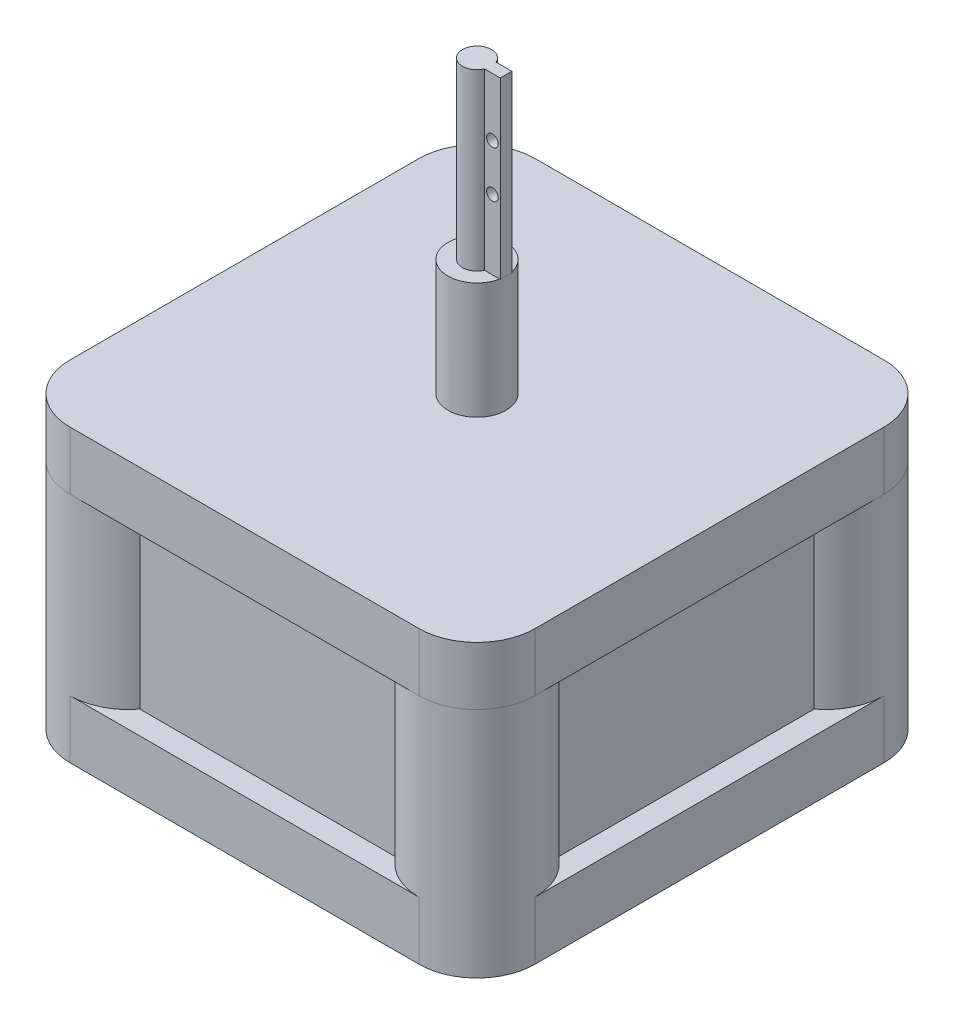
ISO-10303-21;
HEADER;
FILE_DESCRIPTION(('STEP AP214'),'2;1');
FILE_NAME('part.step','',(''),(''),'','','');
FILE_SCHEMA(('AUTOMOTIVE_DESIGN { 1 0 10303 214 1 1 1 1 }'));
ENDSEC;
DATA;
#1=APPLICATION_CONTEXT('core data for automotive mechanical design processes');
#2=APPLICATION_PROTOCOL_DEFINITION('international standard','automotive_design',2000,#1);
#3=PRODUCT_CONTEXT('',#1,'mechanical');
#4=PRODUCT('Part','Part','',(#3));
#5=PRODUCT_RELATED_PRODUCT_CATEGORY('part','',(#4));
#6=PRODUCT_DEFINITION_FORMATION('','',#4);
#7=PRODUCT_DEFINITION_CONTEXT('part definition',#1,'design');
#8=PRODUCT_DEFINITION('design','',#6,#7);
#9=PRODUCT_DEFINITION_SHAPE('','',#8);
#10=(LENGTH_UNIT() NAMED_UNIT(*) SI_UNIT(.MILLI.,.METRE.));
#11=(NAMED_UNIT(*) PLANE_ANGLE_UNIT() SI_UNIT($,.RADIAN.));
#12=(NAMED_UNIT(*) SI_UNIT($,.STERADIAN.) SOLID_ANGLE_UNIT());
#13=UNCERTAINTY_MEASURE_WITH_UNIT(LENGTH_MEASURE(1.E-05),#10,'distance_accuracy_value','');
#14=(GEOMETRIC_REPRESENTATION_CONTEXT(3) GLOBAL_UNCERTAINTY_ASSIGNED_CONTEXT((#13)) GLOBAL_UNIT_ASSIGNED_CONTEXT((#10,
#11,#12)) REPRESENTATION_CONTEXT('',''));
#15=CARTESIAN_POINT('',(0.,0.,0.));
#16=DIRECTION('',(0.,0.,1.));
#17=DIRECTION('',(1.,0.,0.));
#18=AXIS2_PLACEMENT_3D('',#15,#16,#17);
#19=CARTESIAN_POINT('',(0.,6.35,0.));
#20=DIRECTION('',(0.,-1.,0.));
#21=DIRECTION('',(0.,0.,-1.));
#22=AXIS2_PLACEMENT_3D('',#19,#20,#21);
#23=PLANE('',#22);
#24=CARTESIAN_POINT('',(44.45,6.35,-44.45));
#25=DIRECTION('',(0.,1.,0.));
#26=DIRECTION('',(0.,0.,1.));
#27=AXIS2_PLACEMENT_3D('',#24,#25,#26);
#28=CIRCLE('',#27,6.35);
#29=CARTESIAN_POINT('',(48.26,6.35,-39.37));
#30=VERTEX_POINT('',#29);
#31=CARTESIAN_POINT('',(50.8,6.35,-44.45));
#32=VERTEX_POINT('',#31);
#33=EDGE_CURVE('E285',#30,#32,#28,.T.);
#34=ORIENTED_EDGE('',*,*,#33,.F.);
#35=DIRECTION('',(0.,0.,-1.));
#36=VECTOR('',#35,1.);
#37=CARTESIAN_POINT('',(48.26,6.35,-39.37));
#38=LINE('',#37,#36);
#39=CARTESIAN_POINT('',(48.26,6.35,-11.43));
#40=VERTEX_POINT('',#39);
#41=EDGE_CURVE('E352',#40,#30,#38,.T.);
#42=ORIENTED_EDGE('',*,*,#41,.F.);
#43=CARTESIAN_POINT('',(44.45,6.35,-6.35));
#44=DIRECTION('',(0.,1.,0.));
#45=DIRECTION('',(0.,0.,1.));
#46=AXIS2_PLACEMENT_3D('',#43,#44,#45);
#47=CIRCLE('',#46,6.35);
#48=CARTESIAN_POINT('',(50.8,6.35,-6.35));
#49=VERTEX_POINT('',#48);
#50=EDGE_CURVE('E353',#49,#40,#47,.T.);
#51=ORIENTED_EDGE('',*,*,#50,.F.);
#52=DIRECTION('',(0.,0.,-1.));
#53=VECTOR('',#52,1.);
#54=CARTESIAN_POINT('',(50.8,6.35,0.));
#55=LINE('',#54,#53);
#56=EDGE_CURVE('E387',#49,#32,#55,.T.);
#57=ORIENTED_EDGE('',*,*,#56,.T.);
#58=EDGE_LOOP('',(#34,#42,#51,#57));
#59=FACE_BOUND('',#58,.T.);
#60=ADVANCED_FACE('F43',(#59),#23,.F.);
#61=CARTESIAN_POINT('',(39.37,6.35,-2.54));
#62=VERTEX_POINT('',#61);
#63=CARTESIAN_POINT('',(44.45,6.35,0.));
#64=VERTEX_POINT('',#63);
#65=EDGE_CURVE('E349',#62,#64,#47,.T.);
#66=ORIENTED_EDGE('',*,*,#65,.F.);
#67=DIRECTION('',(1.,0.,0.));
#68=VECTOR('',#67,1.);
#69=CARTESIAN_POINT('',(11.43,6.35,-2.54));
#70=LINE('',#69,#68);
#71=CARTESIAN_POINT('',(11.43,6.35,-2.54));
#72=VERTEX_POINT('',#71);
#73=EDGE_CURVE('E345',#72,#62,#70,.T.);
#74=ORIENTED_EDGE('',*,*,#73,.F.);
#75=CARTESIAN_POINT('',(6.35,6.35,-6.35));
#76=DIRECTION('',(0.,1.,0.));
#77=DIRECTION('',(0.,0.,1.));
#78=AXIS2_PLACEMENT_3D('',#75,#76,#77);
#79=CIRCLE('',#78,6.35);
#80=CARTESIAN_POINT('',(6.35,6.35,0.));
#81=VERTEX_POINT('',#80);
#82=EDGE_CURVE('E346',#81,#72,#79,.T.);
#83=ORIENTED_EDGE('',*,*,#82,.F.);
#84=DIRECTION('',(1.,0.,0.));
#85=VECTOR('',#84,1.);
#86=CARTESIAN_POINT('',(0.,6.35,0.));
#87=LINE('',#86,#85);
#88=EDGE_CURVE('E383',#81,#64,#87,.T.);
#89=ORIENTED_EDGE('',*,*,#88,.T.);
#90=EDGE_LOOP('',(#66,#74,#83,#89));
#91=FACE_BOUND('',#90,.T.);
#92=ADVANCED_FACE('F544',(#91),#23,.F.);
#93=CARTESIAN_POINT('',(2.54,6.35,-11.43));
#94=VERTEX_POINT('',#93);
#95=CARTESIAN_POINT('',(0.,6.35,-6.35));
#96=VERTEX_POINT('',#95);
#97=EDGE_CURVE('E342',#94,#96,#79,.T.);
#98=ORIENTED_EDGE('',*,*,#97,.F.);
#99=DIRECTION('',(0.,0.,1.));
#100=VECTOR('',#99,1.);
#101=CARTESIAN_POINT('',(2.54,6.35,-39.37));
#102=LINE('',#101,#100);
#103=CARTESIAN_POINT('',(2.54,6.35,-39.37));
#104=VERTEX_POINT('',#103);
#105=EDGE_CURVE('E338',#104,#94,#102,.T.);
#106=ORIENTED_EDGE('',*,*,#105,.F.);
#107=CARTESIAN_POINT('',(6.35,6.35,-44.45));
#108=DIRECTION('',(0.,1.,0.));
#109=DIRECTION('',(0.,0.,1.));
#110=AXIS2_PLACEMENT_3D('',#107,#108,#109);
#111=CIRCLE('',#110,6.35);
#112=CARTESIAN_POINT('',(0.,6.35,-44.45));
#113=VERTEX_POINT('',#112);
#114=EDGE_CURVE('E339',#113,#104,#111,.T.);
#115=ORIENTED_EDGE('',*,*,#114,.F.);
#116=DIRECTION('',(0.,0.,1.));
#117=VECTOR('',#116,1.);
#118=CARTESIAN_POINT('',(0.,6.35,0.));
#119=LINE('',#118,#117);
#120=EDGE_CURVE('E380',#113,#96,#119,.T.);
#121=ORIENTED_EDGE('',*,*,#120,.T.);
#122=EDGE_LOOP('',(#98,#106,#115,#121));
#123=FACE_BOUND('',#122,.T.);
#124=ADVANCED_FACE('F562',(#123),#23,.F.);
#125=CARTESIAN_POINT('',(44.45,6.35,-50.8));
#126=VERTEX_POINT('',#125);
#127=CARTESIAN_POINT('',(39.37,6.35,-48.26));
#128=VERTEX_POINT('',#127);
#129=EDGE_CURVE('E332',#126,#128,#28,.T.);
#130=ORIENTED_EDGE('',*,*,#129,.F.);
#131=DIRECTION('',(-1.,0.,0.));
#132=VECTOR('',#131,1.);
#133=CARTESIAN_POINT('',(0.,6.35,-50.8));
#134=LINE('',#133,#132);
#135=CARTESIAN_POINT('',(6.35,6.35,-50.8));
#136=VERTEX_POINT('',#135);
#137=EDGE_CURVE('E390',#126,#136,#134,.T.);
#138=ORIENTED_EDGE('',*,*,#137,.T.);
#139=CARTESIAN_POINT('',(11.43,6.35,-48.26));
#140=VERTEX_POINT('',#139);
#141=EDGE_CURVE('E335',#140,#136,#111,.T.);
#142=ORIENTED_EDGE('',*,*,#141,.F.);
#143=DIRECTION('',(-1.,0.,0.));
#144=VECTOR('',#143,1.);
#145=CARTESIAN_POINT('',(11.43,6.35,-48.26));
#146=LINE('',#145,#144);
#147=EDGE_CURVE('E331',#128,#140,#146,.T.);
#148=ORIENTED_EDGE('',*,*,#147,.F.);
#149=EDGE_LOOP('',(#130,#138,#142,#148));
#150=FACE_BOUND('',#149,.T.);
#151=ADVANCED_FACE('F560',(#150),#23,.F.);
#152=CARTESIAN_POINT('',(0.,6.35,0.));
#153=DIRECTION('',(1.,0.,0.));
#154=DIRECTION('',(0.,0.,-1.));
#155=AXIS2_PLACEMENT_3D('',#152,#153,#154);
#156=PLANE('',#155);
#157=ORIENTED_EDGE('',*,*,#120,.F.);
#158=DIRECTION('',(0.,-1.,0.));
#159=VECTOR('',#158,1.);
#160=CARTESIAN_POINT('',(0.,6.35,-44.45));
#161=LINE('',#160,#159);
#162=CARTESIAN_POINT('',(0.,0.,-44.45));
#163=VERTEX_POINT('',#162);
#164=EDGE_CURVE('E405',#113,#163,#161,.T.);
#165=ORIENTED_EDGE('',*,*,#164,.T.);
#166=DIRECTION('',(0.,0.,1.));
#167=VECTOR('',#166,1.);
#168=CARTESIAN_POINT('',(0.,0.,0.));
#169=LINE('',#168,#167);
#170=CARTESIAN_POINT('',(0.,0.,-6.35));
#171=VERTEX_POINT('',#170);
#172=EDGE_CURVE('E379',#163,#171,#169,.T.);
#173=ORIENTED_EDGE('',*,*,#172,.T.);
#174=DIRECTION('',(0.,-1.,0.));
#175=VECTOR('',#174,1.);
#176=CARTESIAN_POINT('',(0.,6.35,-6.35));
#177=LINE('',#176,#175);
#178=EDGE_CURVE('E393',#171,#96,#177,.F.);
#179=ORIENTED_EDGE('',*,*,#178,.T.);
#180=EDGE_LOOP('',(#157,#165,#173,#179));
#181=FACE_BOUND('',#180,.T.);
#182=ADVANCED_FACE('F555',(#181),#156,.F.);
#183=CARTESIAN_POINT('',(0.,6.35,0.));
#184=DIRECTION('',(0.,0.,-1.));
#185=DIRECTION('',(-1.,0.,0.));
#186=AXIS2_PLACEMENT_3D('',#183,#184,#185);
#187=PLANE('',#186);
#188=DIRECTION('',(1.,0.,0.));
#189=VECTOR('',#188,1.);
#190=CARTESIAN_POINT('',(0.,0.,0.));
#191=LINE('',#190,#189);
#192=CARTESIAN_POINT('',(6.35,0.,0.));
#193=VERTEX_POINT('',#192);
#194=CARTESIAN_POINT('',(44.45,0.,0.));
#195=VERTEX_POINT('',#194);
#196=EDGE_CURVE('E396',#193,#195,#191,.T.);
#197=ORIENTED_EDGE('',*,*,#196,.T.);
#198=DIRECTION('',(0.,-1.,0.));
#199=VECTOR('',#198,1.);
#200=CARTESIAN_POINT('',(44.45,6.35,0.));
#201=LINE('',#200,#199);
#202=EDGE_CURVE('E429',#195,#64,#201,.F.);
#203=ORIENTED_EDGE('',*,*,#202,.T.);
#204=ORIENTED_EDGE('',*,*,#88,.F.);
#205=DIRECTION('',(0.,-1.,0.));
#206=VECTOR('',#205,1.);
#207=CARTESIAN_POINT('',(6.35,6.35,0.));
#208=LINE('',#207,#206);
#209=EDGE_CURVE('E426',#81,#193,#208,.T.);
#210=ORIENTED_EDGE('',*,*,#209,.T.);
#211=EDGE_LOOP('',(#197,#203,#204,#210));
#212=FACE_BOUND('',#211,.T.);
#213=ADVANCED_FACE('F547',(#212),#187,.F.);
#214=CARTESIAN_POINT('',(50.8,6.35,0.));
#215=DIRECTION('',(-1.,0.,0.));
#216=DIRECTION('',(0.,0.,1.));
#217=AXIS2_PLACEMENT_3D('',#214,#215,#216);
#218=PLANE('',#217);
#219=DIRECTION('',(0.,0.,-1.));
#220=VECTOR('',#219,1.);
#221=CARTESIAN_POINT('',(50.8,0.,0.));
#222=LINE('',#221,#220);
#223=CARTESIAN_POINT('',(50.8,0.,-6.35));
#224=VERTEX_POINT('',#223);
#225=CARTESIAN_POINT('',(50.8,0.,-44.45));
#226=VERTEX_POINT('',#225);
#227=EDGE_CURVE('E399',#224,#226,#222,.T.);
#228=ORIENTED_EDGE('',*,*,#227,.T.);
#229=DIRECTION('',(0.,-1.,0.));
#230=VECTOR('',#229,1.);
#231=CARTESIAN_POINT('',(50.8,6.35,-44.45));
#232=LINE('',#231,#230);
#233=EDGE_CURVE('E424',#226,#32,#232,.F.);
#234=ORIENTED_EDGE('',*,*,#233,.T.);
#235=ORIENTED_EDGE('',*,*,#56,.F.);
#236=DIRECTION('',(0.,-1.,0.));
#237=VECTOR('',#236,1.);
#238=CARTESIAN_POINT('',(50.8,6.35,-6.35));
#239=LINE('',#238,#237);
#240=EDGE_CURVE('E421',#49,#224,#239,.T.);
#241=ORIENTED_EDGE('',*,*,#240,.T.);
#242=EDGE_LOOP('',(#228,#234,#235,#241));
#243=FACE_BOUND('',#242,.T.);
#244=ADVANCED_FACE('F633',(#243),#218,.F.);
#245=CARTESIAN_POINT('',(0.,6.35,-50.8));
#246=DIRECTION('',(0.,0.,1.));
#247=DIRECTION('',(1.,0.,0.));
#248=AXIS2_PLACEMENT_3D('',#245,#246,#247);
#249=PLANE('',#248);
#250=DIRECTION('',(-1.,0.,0.));
#251=VECTOR('',#250,1.);
#252=CARTESIAN_POINT('',(0.,0.,-50.8));
#253=LINE('',#252,#251);
#254=CARTESIAN_POINT('',(44.45,0.,-50.8));
#255=VERTEX_POINT('',#254);
#256=CARTESIAN_POINT('',(6.35,0.,-50.8));
#257=VERTEX_POINT('',#256);
#258=EDGE_CURVE('E384',#255,#257,#253,.T.);
#259=ORIENTED_EDGE('',*,*,#258,.T.);
#260=DIRECTION('',(0.,-1.,0.));
#261=VECTOR('',#260,1.);
#262=CARTESIAN_POINT('',(6.35,6.35,-50.8));
#263=LINE('',#262,#261);
#264=EDGE_CURVE('E419',#257,#136,#263,.F.);
#265=ORIENTED_EDGE('',*,*,#264,.T.);
#266=ORIENTED_EDGE('',*,*,#137,.F.);
#267=DIRECTION('',(0.,-1.,0.));
#268=VECTOR('',#267,1.);
#269=CARTESIAN_POINT('',(44.45,6.35,-50.8));
#270=LINE('',#269,#268);
#271=EDGE_CURVE('E416',#126,#255,#270,.T.);
#272=ORIENTED_EDGE('',*,*,#271,.T.);
#273=EDGE_LOOP('',(#259,#265,#266,#272));
#274=FACE_BOUND('',#273,.T.);
#275=ADVANCED_FACE('F559',(#274),#249,.F.);
#276=CARTESIAN_POINT('',(0.,0.,0.));
#277=DIRECTION('',(0.,-1.,0.));
#278=DIRECTION('',(0.,0.,-1.));
#279=AXIS2_PLACEMENT_3D('',#276,#277,#278);
#280=PLANE('',#279);
#281=ORIENTED_EDGE('',*,*,#172,.F.);
#282=CARTESIAN_POINT('',(6.35,0.,-44.45));
#283=DIRECTION('',(0.,-1.,0.));
#284=DIRECTION('',(0.,0.,-1.));
#285=AXIS2_PLACEMENT_3D('',#282,#283,#284);
#286=CIRCLE('',#285,6.35);
#287=EDGE_CURVE('E414',#163,#257,#286,.T.);
#288=ORIENTED_EDGE('',*,*,#287,.T.);
#289=ORIENTED_EDGE('',*,*,#258,.F.);
#290=CARTESIAN_POINT('',(44.45,0.,-44.45));
#291=DIRECTION('',(0.,-1.,0.));
#292=DIRECTION('',(0.,0.,-1.));
#293=AXIS2_PLACEMENT_3D('',#290,#291,#292);
#294=CIRCLE('',#293,6.35);
#295=EDGE_CURVE('E412',#255,#226,#294,.T.);
#296=ORIENTED_EDGE('',*,*,#295,.T.);
#297=ORIENTED_EDGE('',*,*,#227,.F.);
#298=CARTESIAN_POINT('',(44.45,0.,-6.35));
#299=DIRECTION('',(0.,-1.,0.));
#300=DIRECTION('',(0.,0.,-1.));
#301=AXIS2_PLACEMENT_3D('',#298,#299,#300);
#302=CIRCLE('',#301,6.35);
#303=EDGE_CURVE('E410',#224,#195,#302,.T.);
#304=ORIENTED_EDGE('',*,*,#303,.T.);
#305=ORIENTED_EDGE('',*,*,#196,.F.);
#306=CARTESIAN_POINT('',(6.35,0.,-6.35));
#307=DIRECTION('',(0.,-1.,0.));
#308=DIRECTION('',(0.,0.,-1.));
#309=AXIS2_PLACEMENT_3D('',#306,#307,#308);
#310=CIRCLE('',#309,6.35);
#311=EDGE_CURVE('E408',#193,#171,#310,.T.);
#312=ORIENTED_EDGE('',*,*,#311,.T.);
#313=EDGE_LOOP('',(#281,#288,#289,#296,#297,#304,#305,#312));
#314=FACE_BOUND('',#313,.T.);
#315=ADVANCED_FACE('F552',(#314),#280,.T.);
#316=CARTESIAN_POINT('',(6.35,6.35,-44.45));
#317=DIRECTION('',(0.,-1.,0.));
#318=DIRECTION('',(0.,0.,-1.));
#319=AXIS2_PLACEMENT_3D('',#316,#317,#318);
#320=CYLINDRICAL_SURFACE('',#319,6.35);
#321=ORIENTED_EDGE('',*,*,#164,.F.);
#322=ORIENTED_EDGE('',*,*,#114,.T.);
#323=DIRECTION('',(0.,-1.,0.));
#324=VECTOR('',#323,1.);
#325=CARTESIAN_POINT('',(2.54,25.4,-39.37));
#326=LINE('',#325,#324);
#327=CARTESIAN_POINT('',(2.54,25.4,-39.37));
#328=VERTEX_POINT('',#327);
#329=EDGE_CURVE('E370',#328,#104,#326,.T.);
#330=ORIENTED_EDGE('',*,*,#329,.F.);
#331=CARTESIAN_POINT('',(6.35,25.4,-44.45));
#332=DIRECTION('',(0.,1.,0.));
#333=DIRECTION('',(0.,0.,1.));
#334=AXIS2_PLACEMENT_3D('',#331,#332,#333);
#335=CIRCLE('',#334,6.35);
#336=CARTESIAN_POINT('',(0.,25.4,-44.45));
#337=VERTEX_POINT('',#336);
#338=EDGE_CURVE('E304',#337,#328,#335,.T.);
#339=ORIENTED_EDGE('',*,*,#338,.F.);
#340=CARTESIAN_POINT('',(6.35,25.4,-50.8));
#341=VERTEX_POINT('',#340);
#342=EDGE_CURVE('E309',#341,#337,#335,.T.);
#343=ORIENTED_EDGE('',*,*,#342,.F.);
#344=CARTESIAN_POINT('',(11.43,25.4,-48.26));
#345=VERTEX_POINT('',#344);
#346=EDGE_CURVE('E305',#345,#341,#335,.T.);
#347=ORIENTED_EDGE('',*,*,#346,.F.);
#348=DIRECTION('',(0.,-1.,0.));
#349=VECTOR('',#348,1.);
#350=CARTESIAN_POINT('',(11.43,25.4,-48.26));
#351=LINE('',#350,#349);
#352=EDGE_CURVE('E373',#345,#140,#351,.T.);
#353=ORIENTED_EDGE('',*,*,#352,.T.);
#354=ORIENTED_EDGE('',*,*,#141,.T.);
#355=ORIENTED_EDGE('',*,*,#264,.F.);
#356=ORIENTED_EDGE('',*,*,#287,.F.);
#357=EDGE_LOOP('',(#321,#322,#330,#339,#343,#347,#353,#354,#355,#356));
#358=FACE_BOUND('',#357,.T.);
#359=ADVANCED_FACE('F529',(#358),#320,.T.);
#360=CARTESIAN_POINT('',(44.45,6.35,-44.45));
#361=DIRECTION('',(0.,-1.,0.));
#362=DIRECTION('',(0.,0.,-1.));
#363=AXIS2_PLACEMENT_3D('',#360,#361,#362);
#364=CYLINDRICAL_SURFACE('',#363,6.35);
#365=ORIENTED_EDGE('',*,*,#271,.F.);
#366=ORIENTED_EDGE('',*,*,#129,.T.);
#367=DIRECTION('',(0.,-1.,0.));
#368=VECTOR('',#367,1.);
#369=CARTESIAN_POINT('',(39.37,25.4,-48.26));
#370=LINE('',#369,#368);
#371=CARTESIAN_POINT('',(39.37,25.4,-48.26));
#372=VERTEX_POINT('',#371);
#373=EDGE_CURVE('E376',#372,#128,#370,.T.);
#374=ORIENTED_EDGE('',*,*,#373,.F.);
#375=CARTESIAN_POINT('',(44.45,25.4,-44.45));
#376=DIRECTION('',(0.,1.,0.));
#377=DIRECTION('',(0.,0.,1.));
#378=AXIS2_PLACEMENT_3D('',#375,#376,#377);
#379=CIRCLE('',#378,6.35);
#380=CARTESIAN_POINT('',(44.45,25.4,-50.8));
#381=VERTEX_POINT('',#380);
#382=EDGE_CURVE('E301',#381,#372,#379,.T.);
#383=ORIENTED_EDGE('',*,*,#382,.F.);
#384=CARTESIAN_POINT('',(50.8,25.4,-44.45));
#385=VERTEX_POINT('',#384);
#386=EDGE_CURVE('E300',#385,#381,#379,.T.);
#387=ORIENTED_EDGE('',*,*,#386,.F.);
#388=CARTESIAN_POINT('',(48.26,25.4,-39.37));
#389=VERTEX_POINT('',#388);
#390=EDGE_CURVE('E296',#389,#385,#379,.T.);
#391=ORIENTED_EDGE('',*,*,#390,.F.);
#392=DIRECTION('',(0.,-1.,0.));
#393=VECTOR('',#392,1.);
#394=CARTESIAN_POINT('',(48.26,25.4,-39.37));
#395=LINE('',#394,#393);
#396=EDGE_CURVE('E328',#389,#30,#395,.T.);
#397=ORIENTED_EDGE('',*,*,#396,.T.);
#398=ORIENTED_EDGE('',*,*,#33,.T.);
#399=ORIENTED_EDGE('',*,*,#233,.F.);
#400=ORIENTED_EDGE('',*,*,#295,.F.);
#401=EDGE_LOOP('',(#365,#366,#374,#383,#387,#391,#397,#398,#399,#400));
#402=FACE_BOUND('',#401,.T.);
#403=ADVANCED_FACE('F487',(#402),#364,.T.);
#404=CARTESIAN_POINT('',(44.45,6.35,-6.35));
#405=DIRECTION('',(0.,-1.,0.));
#406=DIRECTION('',(0.,0.,-1.));
#407=AXIS2_PLACEMENT_3D('',#404,#405,#406);
#408=CYLINDRICAL_SURFACE('',#407,6.35);
#409=ORIENTED_EDGE('',*,*,#240,.F.);
#410=ORIENTED_EDGE('',*,*,#50,.T.);
#411=DIRECTION('',(0.,-1.,0.));
#412=VECTOR('',#411,1.);
#413=CARTESIAN_POINT('',(48.26,25.4,-11.43));
#414=LINE('',#413,#412);
#415=CARTESIAN_POINT('',(48.26,25.4,-11.43));
#416=VERTEX_POINT('',#415);
#417=EDGE_CURVE('E358',#416,#40,#414,.T.);
#418=ORIENTED_EDGE('',*,*,#417,.F.);
#419=CARTESIAN_POINT('',(44.45,25.4,-6.35));
#420=DIRECTION('',(0.,1.,0.));
#421=DIRECTION('',(0.,0.,1.));
#422=AXIS2_PLACEMENT_3D('',#419,#420,#421);
#423=CIRCLE('',#422,6.35);
#424=CARTESIAN_POINT('',(50.8,25.4,-6.35));
#425=VERTEX_POINT('',#424);
#426=EDGE_CURVE('E320',#425,#416,#423,.T.);
#427=ORIENTED_EDGE('',*,*,#426,.F.);
#428=CARTESIAN_POINT('',(44.45,25.4,0.));
#429=VERTEX_POINT('',#428);
#430=EDGE_CURVE('E325',#429,#425,#423,.T.);
#431=ORIENTED_EDGE('',*,*,#430,.F.);
#432=CARTESIAN_POINT('',(39.37,25.4,-2.54));
#433=VERTEX_POINT('',#432);
#434=EDGE_CURVE('E321',#433,#429,#423,.T.);
#435=ORIENTED_EDGE('',*,*,#434,.F.);
#436=DIRECTION('',(0.,-1.,0.));
#437=VECTOR('',#436,1.);
#438=CARTESIAN_POINT('',(39.37,25.4,-2.54));
#439=LINE('',#438,#437);
#440=EDGE_CURVE('E361',#433,#62,#439,.T.);
#441=ORIENTED_EDGE('',*,*,#440,.T.);
#442=ORIENTED_EDGE('',*,*,#65,.T.);
#443=ORIENTED_EDGE('',*,*,#202,.F.);
#444=ORIENTED_EDGE('',*,*,#303,.F.);
#445=EDGE_LOOP('',(#409,#410,#418,#427,#431,#435,#441,#442,#443,#444));
#446=FACE_BOUND('',#445,.T.);
#447=ADVANCED_FACE('F478',(#446),#408,.T.);
#448=CARTESIAN_POINT('',(6.35,6.35,-6.35));
#449=DIRECTION('',(0.,-1.,0.));
#450=DIRECTION('',(0.,0.,-1.));
#451=AXIS2_PLACEMENT_3D('',#448,#449,#450);
#452=CYLINDRICAL_SURFACE('',#451,6.35);
#453=ORIENTED_EDGE('',*,*,#209,.F.);
#454=ORIENTED_EDGE('',*,*,#82,.T.);
#455=DIRECTION('',(0.,-1.,0.));
#456=VECTOR('',#455,1.);
#457=CARTESIAN_POINT('',(11.43,25.4,-2.54));
#458=LINE('',#457,#456);
#459=CARTESIAN_POINT('',(11.43,25.4,-2.54));
#460=VERTEX_POINT('',#459);
#461=EDGE_CURVE('E364',#460,#72,#458,.T.);
#462=ORIENTED_EDGE('',*,*,#461,.F.);
#463=CARTESIAN_POINT('',(6.35,25.4,-6.35));
#464=DIRECTION('',(0.,1.,0.));
#465=DIRECTION('',(0.,0.,1.));
#466=AXIS2_PLACEMENT_3D('',#463,#464,#465);
#467=CIRCLE('',#466,6.35);
#468=CARTESIAN_POINT('',(6.35,25.4,0.));
#469=VERTEX_POINT('',#468);
#470=EDGE_CURVE('E312',#469,#460,#467,.T.);
#471=ORIENTED_EDGE('',*,*,#470,.F.);
#472=CARTESIAN_POINT('',(0.,25.4,-6.35));
#473=VERTEX_POINT('',#472);
#474=EDGE_CURVE('E317',#473,#469,#467,.T.);
#475=ORIENTED_EDGE('',*,*,#474,.F.);
#476=CARTESIAN_POINT('',(2.54,25.4,-11.43));
#477=VERTEX_POINT('',#476);
#478=EDGE_CURVE('E313',#477,#473,#467,.T.);
#479=ORIENTED_EDGE('',*,*,#478,.F.);
#480=DIRECTION('',(0.,-1.,0.));
#481=VECTOR('',#480,1.);
#482=CARTESIAN_POINT('',(2.54,25.4,-11.43));
#483=LINE('',#482,#481);
#484=EDGE_CURVE('E367',#477,#94,#483,.T.);
#485=ORIENTED_EDGE('',*,*,#484,.T.);
#486=ORIENTED_EDGE('',*,*,#97,.T.);
#487=ORIENTED_EDGE('',*,*,#178,.F.);
#488=ORIENTED_EDGE('',*,*,#311,.F.);
#489=EDGE_LOOP('',(#453,#454,#462,#471,#475,#479,#485,#486,#487,#488));
#490=FACE_BOUND('',#489,.T.);
#491=ADVANCED_FACE('F534',(#490),#452,.T.);
#492=CARTESIAN_POINT('',(11.43,25.4,-48.26));
#493=DIRECTION('',(0.,0.,1.));
#494=DIRECTION('',(1.,0.,0.));
#495=AXIS2_PLACEMENT_3D('',#492,#493,#494);
#496=PLANE('',#495);
#497=ORIENTED_EDGE('',*,*,#147,.T.);
#498=ORIENTED_EDGE('',*,*,#352,.F.);
#499=DIRECTION('',(-1.,0.,0.));
#500=VECTOR('',#499,1.);
#501=CARTESIAN_POINT('',(11.43,25.4,-48.26));
#502=LINE('',#501,#500);
#503=EDGE_CURVE('E299',#372,#345,#502,.T.);
#504=ORIENTED_EDGE('',*,*,#503,.F.);
#505=ORIENTED_EDGE('',*,*,#373,.T.);
#506=EDGE_LOOP('',(#497,#498,#504,#505));
#507=FACE_BOUND('',#506,.T.);
#508=ADVANCED_FACE('F505',(#507),#496,.F.);
#509=CARTESIAN_POINT('',(2.54,25.4,-39.37));
#510=DIRECTION('',(1.,0.,0.));
#511=DIRECTION('',(0.,0.,-1.));
#512=AXIS2_PLACEMENT_3D('',#509,#510,#511);
#513=PLANE('',#512);
#514=ORIENTED_EDGE('',*,*,#105,.T.);
#515=ORIENTED_EDGE('',*,*,#484,.F.);
#516=DIRECTION('',(0.,0.,1.));
#517=VECTOR('',#516,1.);
#518=CARTESIAN_POINT('',(2.54,25.4,-39.37));
#519=LINE('',#518,#517);
#520=EDGE_CURVE('E308',#328,#477,#519,.T.);
#521=ORIENTED_EDGE('',*,*,#520,.F.);
#522=ORIENTED_EDGE('',*,*,#329,.T.);
#523=EDGE_LOOP('',(#514,#515,#521,#522));
#524=FACE_BOUND('',#523,.T.);
#525=ADVANCED_FACE('F664',(#524),#513,.F.);
#526=CARTESIAN_POINT('',(11.43,25.4,-2.54));
#527=DIRECTION('',(0.,0.,-1.));
#528=DIRECTION('',(-1.,0.,0.));
#529=AXIS2_PLACEMENT_3D('',#526,#527,#528);
#530=PLANE('',#529);
#531=ORIENTED_EDGE('',*,*,#73,.T.);
#532=ORIENTED_EDGE('',*,*,#440,.F.);
#533=DIRECTION('',(1.,0.,0.));
#534=VECTOR('',#533,1.);
#535=CARTESIAN_POINT('',(11.43,25.4,-2.54));
#536=LINE('',#535,#534);
#537=EDGE_CURVE('E316',#460,#433,#536,.T.);
#538=ORIENTED_EDGE('',*,*,#537,.F.);
#539=ORIENTED_EDGE('',*,*,#461,.T.);
#540=EDGE_LOOP('',(#531,#532,#538,#539));
#541=FACE_BOUND('',#540,.T.);
#542=ADVANCED_FACE('F542',(#541),#530,.F.);
#543=CARTESIAN_POINT('',(48.26,25.4,-39.37));
#544=DIRECTION('',(-1.,0.,0.));
#545=DIRECTION('',(0.,0.,1.));
#546=AXIS2_PLACEMENT_3D('',#543,#544,#545);
#547=PLANE('',#546);
#548=ORIENTED_EDGE('',*,*,#41,.T.);
#549=ORIENTED_EDGE('',*,*,#396,.F.);
#550=DIRECTION('',(0.,0.,-1.));
#551=VECTOR('',#550,1.);
#552=CARTESIAN_POINT('',(48.26,25.4,-39.37));
#553=LINE('',#552,#551);
#554=EDGE_CURVE('E324',#416,#389,#553,.T.);
#555=ORIENTED_EDGE('',*,*,#554,.F.);
#556=ORIENTED_EDGE('',*,*,#417,.T.);
#557=EDGE_LOOP('',(#548,#549,#555,#556));
#558=FACE_BOUND('',#557,.T.);
#559=ADVANCED_FACE('F490',(#558),#547,.F.);
#560=CARTESIAN_POINT('',(0.,25.4,0.));
#561=DIRECTION('',(0.,1.,0.));
#562=DIRECTION('',(0.,0.,1.));
#563=AXIS2_PLACEMENT_3D('',#560,#561,#562);
#564=PLANE('',#563);
#565=ORIENTED_EDGE('',*,*,#554,.T.);
#566=ORIENTED_EDGE('',*,*,#390,.T.);
#567=DIRECTION('',(0.,0.,-1.));
#568=VECTOR('',#567,1.);
#569=CARTESIAN_POINT('',(50.8,25.4,-50.8));
#570=LINE('',#569,#568);
#571=EDGE_CURVE('E291',#425,#385,#570,.T.);
#572=ORIENTED_EDGE('',*,*,#571,.F.);
#573=ORIENTED_EDGE('',*,*,#426,.T.);
#574=EDGE_LOOP('',(#565,#566,#572,#573));
#575=FACE_BOUND('',#574,.T.);
#576=ADVANCED_FACE('F483',(#575),#564,.F.);
#577=DIRECTION('',(-1.,0.,0.));
#578=VECTOR('',#577,1.);
#579=CARTESIAN_POINT('',(0.,25.4,-50.8));
#580=LINE('',#579,#578);
#581=EDGE_CURVE('E276',#381,#341,#580,.T.);
#582=ORIENTED_EDGE('',*,*,#581,.F.);
#583=ORIENTED_EDGE('',*,*,#382,.T.);
#584=ORIENTED_EDGE('',*,*,#503,.T.);
#585=ORIENTED_EDGE('',*,*,#346,.T.);
#586=EDGE_LOOP('',(#582,#583,#584,#585));
#587=FACE_BOUND('',#586,.T.);
#588=ADVANCED_FACE('F509',(#587),#564,.F.);
#589=DIRECTION('',(0.,0.,1.));
#590=VECTOR('',#589,1.);
#591=CARTESIAN_POINT('',(0.,25.4,-50.8));
#592=LINE('',#591,#590);
#593=EDGE_CURVE('E269',#337,#473,#592,.T.);
#594=ORIENTED_EDGE('',*,*,#593,.F.);
#595=ORIENTED_EDGE('',*,*,#338,.T.);
#596=ORIENTED_EDGE('',*,*,#520,.T.);
#597=ORIENTED_EDGE('',*,*,#478,.T.);
#598=EDGE_LOOP('',(#594,#595,#596,#597));
#599=FACE_BOUND('',#598,.T.);
#600=ADVANCED_FACE('F532',(#599),#564,.F.);
#601=DIRECTION('',(1.,0.,0.));
#602=VECTOR('',#601,1.);
#603=CARTESIAN_POINT('',(0.,25.4,0.));
#604=LINE('',#603,#602);
#605=EDGE_CURVE('E288',#469,#429,#604,.T.);
#606=ORIENTED_EDGE('',*,*,#605,.F.);
#607=ORIENTED_EDGE('',*,*,#470,.T.);
#608=ORIENTED_EDGE('',*,*,#537,.T.);
#609=ORIENTED_EDGE('',*,*,#434,.T.);
#610=EDGE_LOOP('',(#606,#607,#608,#609));
#611=FACE_BOUND('',#610,.T.);
#612=ADVANCED_FACE('F538',(#611),#564,.F.);
#613=CARTESIAN_POINT('',(0.,31.75,-50.8));
#614=DIRECTION('',(1.,0.,0.));
#615=DIRECTION('',(0.,0.,-1.));
#616=AXIS2_PLACEMENT_3D('',#613,#614,#615);
#617=PLANE('',#616);
#618=DIRECTION('',(0.,0.,1.));
#619=VECTOR('',#618,1.);
#620=CARTESIAN_POINT('',(0.,31.75,-50.8));
#621=LINE('',#620,#619);
#622=CARTESIAN_POINT('',(0.,31.75,-44.45));
#623=VERTEX_POINT('',#622);
#624=CARTESIAN_POINT('',(0.,31.75,-6.35));
#625=VERTEX_POINT('',#624);
#626=EDGE_CURVE('E272',#623,#625,#621,.T.);
#627=ORIENTED_EDGE('',*,*,#626,.F.);
#628=DIRECTION('',(0.,-1.,0.));
#629=VECTOR('',#628,1.);
#630=CARTESIAN_POINT('',(0.,31.75,-44.45));
#631=LINE('',#630,#629);
#632=EDGE_CURVE('E451',#623,#337,#631,.T.);
#633=ORIENTED_EDGE('',*,*,#632,.T.);
#634=ORIENTED_EDGE('',*,*,#593,.T.);
#635=DIRECTION('',(0.,-1.,0.));
#636=VECTOR('',#635,1.);
#637=CARTESIAN_POINT('',(0.,31.75,-6.35));
#638=LINE('',#637,#636);
#639=EDGE_CURVE('E449',#473,#625,#638,.F.);
#640=ORIENTED_EDGE('',*,*,#639,.T.);
#641=EDGE_LOOP('',(#627,#633,#634,#640));
#642=FACE_BOUND('',#641,.T.);
#643=ADVANCED_FACE('F525',(#642),#617,.F.);
#644=CARTESIAN_POINT('',(0.,31.75,0.));
#645=DIRECTION('',(0.,0.,-1.));
#646=DIRECTION('',(-1.,0.,0.));
#647=AXIS2_PLACEMENT_3D('',#644,#645,#646);
#648=PLANE('',#647);
#649=ORIENTED_EDGE('',*,*,#605,.T.);
#650=DIRECTION('',(0.,-1.,0.));
#651=VECTOR('',#650,1.);
#652=CARTESIAN_POINT('',(44.45,31.75,0.));
#653=LINE('',#652,#651);
#654=CARTESIAN_POINT('',(44.45,31.75,0.));
#655=VERTEX_POINT('',#654);
#656=EDGE_CURVE('E47',#429,#655,#653,.F.);
#657=ORIENTED_EDGE('',*,*,#656,.T.);
#658=DIRECTION('',(1.,0.,0.));
#659=VECTOR('',#658,1.);
#660=CARTESIAN_POINT('',(0.,31.75,0.));
#661=LINE('',#660,#659);
#662=CARTESIAN_POINT('',(6.35,31.75,0.));
#663=VERTEX_POINT('',#662);
#664=EDGE_CURVE('E275',#663,#655,#661,.T.);
#665=ORIENTED_EDGE('',*,*,#664,.F.);
#666=DIRECTION('',(0.,-1.,0.));
#667=VECTOR('',#666,1.);
#668=CARTESIAN_POINT('',(6.35,31.75,0.));
#669=LINE('',#668,#667);
#670=EDGE_CURVE('E453',#663,#469,#669,.T.);
#671=ORIENTED_EDGE('',*,*,#670,.T.);
#672=EDGE_LOOP('',(#649,#657,#665,#671));
#673=FACE_BOUND('',#672,.T.);
#674=ADVANCED_FACE('F460',(#673),#648,.F.);
#675=CARTESIAN_POINT('',(50.8,31.75,-50.8));
#676=DIRECTION('',(-1.,0.,0.));
#677=DIRECTION('',(0.,0.,1.));
#678=AXIS2_PLACEMENT_3D('',#675,#676,#677);
#679=PLANE('',#678);
#680=ORIENTED_EDGE('',*,*,#571,.T.);
#681=DIRECTION('',(0.,-1.,0.));
#682=VECTOR('',#681,1.);
#683=CARTESIAN_POINT('',(50.8,31.75,-44.45));
#684=LINE('',#683,#682);
#685=CARTESIAN_POINT('',(50.8,31.75,-44.45));
#686=VERTEX_POINT('',#685);
#687=EDGE_CURVE('E439',#385,#686,#684,.F.);
#688=ORIENTED_EDGE('',*,*,#687,.T.);
#689=DIRECTION('',(0.,0.,-1.));
#690=VECTOR('',#689,1.);
#691=CARTESIAN_POINT('',(50.8,31.75,-50.8));
#692=LINE('',#691,#690);
#693=CARTESIAN_POINT('',(50.8,31.75,-6.35));
#694=VERTEX_POINT('',#693);
#695=EDGE_CURVE('E279',#694,#686,#692,.T.);
#696=ORIENTED_EDGE('',*,*,#695,.F.);
#697=DIRECTION('',(0.,-1.,0.));
#698=VECTOR('',#697,1.);
#699=CARTESIAN_POINT('',(50.8,31.75,-6.35));
#700=LINE('',#699,#698);
#701=EDGE_CURVE('E436',#694,#425,#700,.T.);
#702=ORIENTED_EDGE('',*,*,#701,.T.);
#703=EDGE_LOOP('',(#680,#688,#696,#702));
#704=FACE_BOUND('',#703,.T.);
#705=ADVANCED_FACE('F472',(#704),#679,.F.);
#706=CARTESIAN_POINT('',(0.,31.75,-50.8));
#707=DIRECTION('',(0.,0.,1.));
#708=DIRECTION('',(1.,0.,0.));
#709=AXIS2_PLACEMENT_3D('',#706,#707,#708);
#710=PLANE('',#709);
#711=DIRECTION('',(-1.,0.,0.));
#712=VECTOR('',#711,1.);
#713=CARTESIAN_POINT('',(0.,31.75,-50.8));
#714=LINE('',#713,#712);
#715=CARTESIAN_POINT('',(44.45,31.75,-50.8));
#716=VERTEX_POINT('',#715);
#717=CARTESIAN_POINT('',(6.35,31.75,-50.8));
#718=VERTEX_POINT('',#717);
#719=EDGE_CURVE('E282',#716,#718,#714,.T.);
#720=ORIENTED_EDGE('',*,*,#719,.F.);
#721=DIRECTION('',(0.,-1.,0.));
#722=VECTOR('',#721,1.);
#723=CARTESIAN_POINT('',(44.45,31.75,-50.8));
#724=LINE('',#723,#722);
#725=EDGE_CURVE('E433',#716,#381,#724,.T.);
#726=ORIENTED_EDGE('',*,*,#725,.T.);
#727=ORIENTED_EDGE('',*,*,#581,.T.);
#728=DIRECTION('',(0.,-1.,0.));
#729=VECTOR('',#728,1.);
#730=CARTESIAN_POINT('',(6.35,31.75,-50.8));
#731=LINE('',#730,#729);
#732=EDGE_CURVE('E431',#341,#718,#731,.F.);
#733=ORIENTED_EDGE('',*,*,#732,.T.);
#734=EDGE_LOOP('',(#720,#726,#727,#733));
#735=FACE_BOUND('',#734,.T.);
#736=ADVANCED_FACE('F516',(#735),#710,.F.);
#737=CARTESIAN_POINT('',(0.,31.75,0.));
#738=DIRECTION('',(0.,1.,0.));
#739=DIRECTION('',(0.,0.,1.));
#740=AXIS2_PLACEMENT_3D('',#737,#738,#739);
#741=PLANE('',#740);
#742=CARTESIAN_POINT('',(25.4,31.75,-25.4));
#743=DIRECTION('',(0.,1.,0.));
#744=DIRECTION('',(0.,0.,1.));
#745=AXIS2_PLACEMENT_3D('',#742,#743,#744);
#746=CIRCLE('',#745,3.175);
#747=CARTESIAN_POINT('',(25.4,31.75,-22.225));
#748=VERTEX_POINT('',#747);
#749=EDGE_CURVE('E258',#748,#748,#746,.T.);
#750=ORIENTED_EDGE('',*,*,#749,.F.);
#751=EDGE_LOOP('',(#750));
#752=FACE_BOUND('',#751,.T.);
#753=ORIENTED_EDGE('',*,*,#695,.T.);
#754=CARTESIAN_POINT('',(44.45,31.75,-44.45));
#755=DIRECTION('',(0.,1.,0.));
#756=DIRECTION('',(0.,0.,1.));
#757=AXIS2_PLACEMENT_3D('',#754,#755,#756);
#758=CIRCLE('',#757,6.35);
#759=EDGE_CURVE('E447',#686,#716,#758,.T.);
#760=ORIENTED_EDGE('',*,*,#759,.T.);
#761=ORIENTED_EDGE('',*,*,#719,.T.);
#762=CARTESIAN_POINT('',(6.35,31.75,-44.45));
#763=DIRECTION('',(0.,1.,0.));
#764=DIRECTION('',(0.,0.,1.));
#765=AXIS2_PLACEMENT_3D('',#762,#763,#764);
#766=CIRCLE('',#765,6.35);
#767=EDGE_CURVE('E445',#718,#623,#766,.T.);
#768=ORIENTED_EDGE('',*,*,#767,.T.);
#769=ORIENTED_EDGE('',*,*,#626,.T.);
#770=CARTESIAN_POINT('',(6.35,31.75,-6.35));
#771=DIRECTION('',(0.,1.,0.));
#772=DIRECTION('',(0.,0.,1.));
#773=AXIS2_PLACEMENT_3D('',#770,#771,#772);
#774=CIRCLE('',#773,6.35);
#775=EDGE_CURVE('E441',#625,#663,#774,.T.);
#776=ORIENTED_EDGE('',*,*,#775,.T.);
#777=ORIENTED_EDGE('',*,*,#664,.T.);
#778=CARTESIAN_POINT('',(44.45,31.75,-6.35));
#779=DIRECTION('',(0.,1.,0.));
#780=DIRECTION('',(0.,0.,1.));
#781=AXIS2_PLACEMENT_3D('',#778,#779,#780);
#782=CIRCLE('',#781,6.35);
#783=EDGE_CURVE('E443',#655,#694,#782,.T.);
#784=ORIENTED_EDGE('',*,*,#783,.T.);
#785=EDGE_LOOP('',(#753,#760,#761,#768,#769,#776,#777,#784));
#786=FACE_BOUND('',#785,.T.);
#787=ADVANCED_FACE('F465',(#752,#786),#741,.T.);
#788=CARTESIAN_POINT('',(44.45,31.75,-44.45));
#789=DIRECTION('',(0.,-1.,0.));
#790=DIRECTION('',(0.,0.,-1.));
#791=AXIS2_PLACEMENT_3D('',#788,#789,#790);
#792=CYLINDRICAL_SURFACE('',#791,6.35);
#793=ORIENTED_EDGE('',*,*,#759,.F.);
#794=ORIENTED_EDGE('',*,*,#687,.F.);
#795=ORIENTED_EDGE('',*,*,#386,.T.);
#796=ORIENTED_EDGE('',*,*,#725,.F.);
#797=EDGE_LOOP('',(#793,#794,#795,#796));
#798=FACE_BOUND('',#797,.T.);
#799=ADVANCED_FACE('F513',(#798),#792,.T.);
#800=CARTESIAN_POINT('',(6.35,31.75,-44.45));
#801=DIRECTION('',(0.,-1.,0.));
#802=DIRECTION('',(0.,0.,-1.));
#803=AXIS2_PLACEMENT_3D('',#800,#801,#802);
#804=CYLINDRICAL_SURFACE('',#803,6.35);
#805=ORIENTED_EDGE('',*,*,#767,.F.);
#806=ORIENTED_EDGE('',*,*,#732,.F.);
#807=ORIENTED_EDGE('',*,*,#342,.T.);
#808=ORIENTED_EDGE('',*,*,#632,.F.);
#809=EDGE_LOOP('',(#805,#806,#807,#808));
#810=FACE_BOUND('',#809,.T.);
#811=ADVANCED_FACE('F522',(#810),#804,.T.);
#812=CARTESIAN_POINT('',(44.45,31.75,-6.35));
#813=DIRECTION('',(0.,-1.,0.));
#814=DIRECTION('',(0.,0.,-1.));
#815=AXIS2_PLACEMENT_3D('',#812,#813,#814);
#816=CYLINDRICAL_SURFACE('',#815,6.35);
#817=ORIENTED_EDGE('',*,*,#783,.F.);
#818=ORIENTED_EDGE('',*,*,#656,.F.);
#819=ORIENTED_EDGE('',*,*,#430,.T.);
#820=ORIENTED_EDGE('',*,*,#701,.F.);
#821=EDGE_LOOP('',(#817,#818,#819,#820));
#822=FACE_BOUND('',#821,.T.);
#823=ADVANCED_FACE('F469',(#822),#816,.T.);
#824=CARTESIAN_POINT('',(6.35,31.75,-6.35));
#825=DIRECTION('',(0.,-1.,0.));
#826=DIRECTION('',(0.,0.,-1.));
#827=AXIS2_PLACEMENT_3D('',#824,#825,#826);
#828=CYLINDRICAL_SURFACE('',#827,6.35);
#829=ORIENTED_EDGE('',*,*,#775,.F.);
#830=ORIENTED_EDGE('',*,*,#639,.F.);
#831=ORIENTED_EDGE('',*,*,#474,.T.);
#832=ORIENTED_EDGE('',*,*,#670,.F.);
#833=EDGE_LOOP('',(#829,#830,#831,#832));
#834=FACE_BOUND('',#833,.T.);
#835=ADVANCED_FACE('F45',(#834),#828,.T.);
#836=CARTESIAN_POINT('',(25.4,44.45,-25.4));
#837=DIRECTION('',(0.,-1.,0.));
#838=DIRECTION('',(0.,0.,-1.));
#839=AXIS2_PLACEMENT_3D('',#836,#837,#838);
#840=CYLINDRICAL_SURFACE('',#839,3.175);
#841=CARTESIAN_POINT('',(25.4,44.45,-25.4));
#842=DIRECTION('',(0.,1.,0.));
#843=DIRECTION('',(0.,0.,1.));
#844=AXIS2_PLACEMENT_3D('',#841,#842,#843);
#845=CIRCLE('',#844,3.175);
#846=CARTESIAN_POINT('',(28.5108519733346,44.45,-24.765));
#847=VERTEX_POINT('',#846);
#848=CARTESIAN_POINT('',(28.575,44.45,-25.4));
#849=VERTEX_POINT('',#848);
#850=EDGE_CURVE('E267',#847,#849,#845,.T.);
#851=ORIENTED_EDGE('',*,*,#850,.F.);
#852=CARTESIAN_POINT('',(28.5108519733346,44.45,-26.035));
#853=VERTEX_POINT('',#852);
#854=EDGE_CURVE('E261',#853,#847,#845,.T.);
#855=ORIENTED_EDGE('',*,*,#854,.F.);
#856=EDGE_CURVE('E270',#849,#853,#845,.T.);
#857=ORIENTED_EDGE('',*,*,#856,.F.);
#858=EDGE_LOOP('',(#851,#855,#857));
#859=FACE_BOUND('',#858,.T.);
#860=ORIENTED_EDGE('',*,*,#749,.T.);
#861=EDGE_LOOP('',(#860));
#862=FACE_BOUND('',#861,.T.);
#863=ADVANCED_FACE('F780',(#859,#862),#840,.T.);
#864=CARTESIAN_POINT('',(25.4,44.45,-25.4));
#865=DIRECTION('',(0.,1.,0.));
#866=DIRECTION('',(0.,0.,1.));
#867=AXIS2_PLACEMENT_3D('',#864,#865,#866);
#868=PLANE('',#867);
#869=DIRECTION('',(-1.,0.,0.));
#870=VECTOR('',#869,1.);
#871=CARTESIAN_POINT('',(28.575,44.45,-26.035));
#872=LINE('',#871,#870);
#873=CARTESIAN_POINT('',(26.8549677831485,44.45,-26.035));
#874=VERTEX_POINT('',#873);
#875=EDGE_CURVE('E11',#853,#874,#872,.T.);
#876=ORIENTED_EDGE('',*,*,#875,.F.);
#877=ORIENTED_EDGE('',*,*,#854,.T.);
#878=DIRECTION('',(1.,0.,0.));
#879=VECTOR('',#878,1.);
#880=CARTESIAN_POINT('',(28.575,44.45,-24.765));
#881=LINE('',#880,#879);
#882=CARTESIAN_POINT('',(26.8549677831485,44.45,-24.765));
#883=VERTEX_POINT('',#882);
#884=EDGE_CURVE('E932',#883,#847,#881,.T.);
#885=ORIENTED_EDGE('',*,*,#884,.F.);
#886=CARTESIAN_POINT('',(25.4,44.45,-25.4));
#887=DIRECTION('',(0.,1.,0.));
#888=DIRECTION('',(0.,0.,1.));
#889=AXIS2_PLACEMENT_3D('',#886,#887,#888);
#890=CIRCLE('',#889,1.5875);
#891=EDGE_CURVE('E60',#874,#883,#890,.T.);
#892=ORIENTED_EDGE('',*,*,#891,.F.);
#893=EDGE_LOOP('',(#876,#877,#885,#892));
#894=FACE_BOUND('',#893,.T.);
#895=ADVANCED_FACE('F794',(#894),#868,.T.);
#896=CARTESIAN_POINT('',(25.4,44.45,-25.4));
#897=DIRECTION('',(0.,1.,0.));
#898=DIRECTION('',(0.,0.,1.));
#899=AXIS2_PLACEMENT_3D('',#896,#897,#898);
#900=PLANE('',#899);
#901=CARTESIAN_POINT('',(28.575,44.45,-24.765));
#902=VERTEX_POINT('',#901);
#903=EDGE_CURVE('E931',#847,#902,#881,.T.);
#904=ORIENTED_EDGE('',*,*,#903,.F.);
#905=ORIENTED_EDGE('',*,*,#850,.T.);
#906=DIRECTION('',(0.,0.,-1.));
#907=VECTOR('',#906,1.);
#908=CARTESIAN_POINT('',(28.575,44.45,-26.035));
#909=LINE('',#908,#907);
#910=EDGE_CURVE('E254',#902,#849,#909,.T.);
#911=ORIENTED_EDGE('',*,*,#910,.F.);
#912=EDGE_LOOP('',(#904,#905,#911));
#913=FACE_BOUND('',#912,.T.);
#914=ADVANCED_FACE('F803',(#913),#900,.F.);
#915=CARTESIAN_POINT('',(28.575,44.45,-26.035));
#916=VERTEX_POINT('',#915);
#917=EDGE_CURVE('E935',#849,#916,#909,.T.);
#918=ORIENTED_EDGE('',*,*,#917,.F.);
#919=ORIENTED_EDGE('',*,*,#856,.T.);
#920=EDGE_CURVE('E53',#916,#853,#872,.T.);
#921=ORIENTED_EDGE('',*,*,#920,.F.);
#922=EDGE_LOOP('',(#918,#919,#921));
#923=FACE_BOUND('',#922,.T.);
#924=ADVANCED_FACE('F811',(#923),#900,.F.);
#925=CARTESIAN_POINT('',(28.575,63.5,-26.035));
#926=DIRECTION('',(0.,0.,1.));
#927=DIRECTION('',(1.,0.,0.));
#928=AXIS2_PLACEMENT_3D('',#925,#926,#927);
#929=PLANE('',#928);
#930=CARTESIAN_POINT('',(27.715591,52.07,-26.035));
#931=DIRECTION('',(0.,0.,1.));
#932=DIRECTION('',(1.,0.,0.));
#933=AXIS2_PLACEMENT_3D('',#930,#931,#932);
#934=CIRCLE('',#933,0.634999999999999);
#935=CARTESIAN_POINT('',(28.350591,52.07,-26.035));
#936=VERTEX_POINT('',#935);
#937=EDGE_CURVE('E920',#936,#936,#934,.T.);
#938=ORIENTED_EDGE('',*,*,#937,.T.);
#939=EDGE_LOOP('',(#938));
#940=FACE_BOUND('',#939,.T.);
#941=CARTESIAN_POINT('',(27.715591,57.15,-26.035));
#942=DIRECTION('',(0.,0.,1.));
#943=DIRECTION('',(1.,0.,0.));
#944=AXIS2_PLACEMENT_3D('',#941,#942,#943);
#945=CIRCLE('',#944,0.634999999999999);
#946=CARTESIAN_POINT('',(28.350591,57.15,-26.035));
#947=VERTEX_POINT('',#946);
#948=EDGE_CURVE('E921',#947,#947,#945,.T.);
#949=ORIENTED_EDGE('',*,*,#948,.T.);
#950=EDGE_LOOP('',(#949));
#951=FACE_BOUND('',#950,.T.);
#952=ORIENTED_EDGE('',*,*,#920,.T.);
#953=ORIENTED_EDGE('',*,*,#875,.T.);
#954=DIRECTION('',(0.,-1.,0.));
#955=VECTOR('',#954,1.);
#956=CARTESIAN_POINT('',(26.8549677831485,63.5,-26.035));
#957=LINE('',#956,#955);
#958=CARTESIAN_POINT('',(26.8549677831485,63.5,-26.035));
#959=VERTEX_POINT('',#958);
#960=EDGE_CURVE('E239',#959,#874,#957,.T.);
#961=ORIENTED_EDGE('',*,*,#960,.F.);
#962=DIRECTION('',(-1.,0.,0.));
#963=VECTOR('',#962,1.);
#964=CARTESIAN_POINT('',(28.575,63.5,-26.035));
#965=LINE('',#964,#963);
#966=CARTESIAN_POINT('',(28.575,63.5,-26.035));
#967=VERTEX_POINT('',#966);
#968=EDGE_CURVE('E245',#967,#959,#965,.T.);
#969=ORIENTED_EDGE('',*,*,#968,.F.);
#970=DIRECTION('',(0.,-1.,0.));
#971=VECTOR('',#970,1.);
#972=CARTESIAN_POINT('',(28.575,63.5,-26.035));
#973=LINE('',#972,#971);
#974=EDGE_CURVE('E928',#967,#916,#973,.T.);
#975=ORIENTED_EDGE('',*,*,#974,.T.);
#976=EDGE_LOOP('',(#952,#953,#961,#969,#975));
#977=FACE_BOUND('',#976,.T.);
#978=ADVANCED_FACE('F257',(#940,#951,#977),#929,.F.);
#979=CARTESIAN_POINT('',(25.4,63.5,-25.4));
#980=DIRECTION('',(0.,-1.,0.));
#981=DIRECTION('',(0.,0.,-1.));
#982=AXIS2_PLACEMENT_3D('',#979,#980,#981);
#983=CYLINDRICAL_SURFACE('',#982,1.5875);
#984=ORIENTED_EDGE('',*,*,#891,.T.);
#985=DIRECTION('',(0.,-1.,0.));
#986=VECTOR('',#985,1.);
#987=CARTESIAN_POINT('',(26.8549677831485,63.5,-24.765));
#988=LINE('',#987,#986);
#989=CARTESIAN_POINT('',(26.8549677831485,63.5,-24.765));
#990=VERTEX_POINT('',#989);
#991=EDGE_CURVE('E241',#990,#883,#988,.T.);
#992=ORIENTED_EDGE('',*,*,#991,.F.);
#993=CARTESIAN_POINT('',(25.4,63.5,-25.4));
#994=DIRECTION('',(0.,1.,0.));
#995=DIRECTION('',(0.,0.,1.));
#996=AXIS2_PLACEMENT_3D('',#993,#994,#995);
#997=CIRCLE('',#996,1.5875);
#998=EDGE_CURVE('E235',#959,#990,#997,.T.);
#999=ORIENTED_EDGE('',*,*,#998,.F.);
#1000=ORIENTED_EDGE('',*,*,#960,.T.);
#1001=EDGE_LOOP('',(#984,#992,#999,#1000));
#1002=FACE_BOUND('',#1001,.T.);
#1003=ADVANCED_FACE('F237',(#1002),#983,.T.);
#1004=CARTESIAN_POINT('',(28.575,63.5,-24.765));
#1005=DIRECTION('',(0.,0.,-1.));
#1006=DIRECTION('',(-1.,0.,0.));
#1007=AXIS2_PLACEMENT_3D('',#1004,#1005,#1006);
#1008=PLANE('',#1007);
#1009=CARTESIAN_POINT('',(27.715591,52.07,-24.765));
#1010=DIRECTION('',(0.,0.,1.));
#1011=DIRECTION('',(1.,0.,0.));
#1012=AXIS2_PLACEMENT_3D('',#1009,#1010,#1011);
#1013=CIRCLE('',#1012,0.634999999999999);
#1014=CARTESIAN_POINT('',(28.350591,52.07,-24.765));
#1015=VERTEX_POINT('',#1014);
#1016=EDGE_CURVE('E917',#1015,#1015,#1013,.T.);
#1017=ORIENTED_EDGE('',*,*,#1016,.F.);
#1018=EDGE_LOOP('',(#1017));
#1019=FACE_BOUND('',#1018,.T.);
#1020=CARTESIAN_POINT('',(27.715591,57.15,-24.765));
#1021=DIRECTION('',(0.,0.,1.));
#1022=DIRECTION('',(1.,0.,0.));
#1023=AXIS2_PLACEMENT_3D('',#1020,#1021,#1022);
#1024=CIRCLE('',#1023,0.634999999999999);
#1025=CARTESIAN_POINT('',(28.350591,57.15,-24.765));
#1026=VERTEX_POINT('',#1025);
#1027=EDGE_CURVE('E949',#1026,#1026,#1024,.T.);
#1028=ORIENTED_EDGE('',*,*,#1027,.F.);
#1029=EDGE_LOOP('',(#1028));
#1030=FACE_BOUND('',#1029,.T.);
#1031=ORIENTED_EDGE('',*,*,#884,.T.);
#1032=ORIENTED_EDGE('',*,*,#903,.T.);
#1033=DIRECTION('',(0.,-1.,0.));
#1034=VECTOR('',#1033,1.);
#1035=CARTESIAN_POINT('',(28.575,63.5,-24.765));
#1036=LINE('',#1035,#1034);
#1037=CARTESIAN_POINT('',(28.575,63.5,-24.765));
#1038=VERTEX_POINT('',#1037);
#1039=EDGE_CURVE('E263',#1038,#902,#1036,.T.);
#1040=ORIENTED_EDGE('',*,*,#1039,.F.);
#1041=DIRECTION('',(1.,0.,0.));
#1042=VECTOR('',#1041,1.);
#1043=CARTESIAN_POINT('',(28.575,63.5,-24.765));
#1044=LINE('',#1043,#1042);
#1045=EDGE_CURVE('E244',#990,#1038,#1044,.T.);
#1046=ORIENTED_EDGE('',*,*,#1045,.F.);
#1047=ORIENTED_EDGE('',*,*,#991,.T.);
#1048=EDGE_LOOP('',(#1031,#1032,#1040,#1046,#1047));
#1049=FACE_BOUND('',#1048,.T.);
#1050=ADVANCED_FACE('F828',(#1019,#1030,#1049),#1008,.F.);
#1051=CARTESIAN_POINT('',(28.575,63.5,-26.035));
#1052=DIRECTION('',(-1.,0.,0.));
#1053=DIRECTION('',(0.,0.,1.));
#1054=AXIS2_PLACEMENT_3D('',#1051,#1052,#1053);
#1055=PLANE('',#1054);
#1056=ORIENTED_EDGE('',*,*,#910,.T.);
#1057=ORIENTED_EDGE('',*,*,#917,.T.);
#1058=ORIENTED_EDGE('',*,*,#974,.F.);
#1059=DIRECTION('',(0.,0.,-1.));
#1060=VECTOR('',#1059,1.);
#1061=CARTESIAN_POINT('',(28.575,63.5,-26.035));
#1062=LINE('',#1061,#1060);
#1063=EDGE_CURVE('E250',#1038,#967,#1062,.T.);
#1064=ORIENTED_EDGE('',*,*,#1063,.F.);
#1065=ORIENTED_EDGE('',*,*,#1039,.T.);
#1066=EDGE_LOOP('',(#1056,#1057,#1058,#1064,#1065));
#1067=FACE_BOUND('',#1066,.T.);
#1068=ADVANCED_FACE('F834',(#1067),#1055,.F.);
#1069=CARTESIAN_POINT('',(25.4,63.5,-25.4));
#1070=DIRECTION('',(0.,1.,0.));
#1071=DIRECTION('',(0.,0.,1.));
#1072=AXIS2_PLACEMENT_3D('',#1069,#1070,#1071);
#1073=PLANE('',#1072);
#1074=ORIENTED_EDGE('',*,*,#968,.T.);
#1075=ORIENTED_EDGE('',*,*,#998,.T.);
#1076=ORIENTED_EDGE('',*,*,#1045,.T.);
#1077=ORIENTED_EDGE('',*,*,#1063,.T.);
#1078=EDGE_LOOP('',(#1074,#1075,#1076,#1077));
#1079=FACE_BOUND('',#1078,.T.);
#1080=ADVANCED_FACE('F248',(#1079),#1073,.T.);
#1081=CARTESIAN_POINT('',(27.715591,57.15,-27.305));
#1082=DIRECTION('',(0.,0.,1.));
#1083=DIRECTION('',(1.,0.,0.));
#1084=AXIS2_PLACEMENT_3D('',#1081,#1082,#1083);
#1085=CYLINDRICAL_SURFACE('',#1084,0.634999999999999);
#1086=ORIENTED_EDGE('',*,*,#1027,.T.);
#1087=EDGE_LOOP('',(#1086));
#1088=FACE_BOUND('',#1087,.T.);
#1089=ORIENTED_EDGE('',*,*,#948,.F.);
#1090=EDGE_LOOP('',(#1089));
#1091=FACE_BOUND('',#1090,.T.);
#1092=ADVANCED_FACE('F846',(#1088,#1091),#1085,.F.);
#1093=CARTESIAN_POINT('',(27.715591,52.07,-27.305));
#1094=DIRECTION('',(0.,0.,1.));
#1095=DIRECTION('',(1.,0.,0.));
#1096=AXIS2_PLACEMENT_3D('',#1093,#1094,#1095);
#1097=CYLINDRICAL_SURFACE('',#1096,0.634999999999999);
#1098=ORIENTED_EDGE('',*,*,#1016,.T.);
#1099=EDGE_LOOP('',(#1098));
#1100=FACE_BOUND('',#1099,.T.);
#1101=ORIENTED_EDGE('',*,*,#937,.F.);
#1102=EDGE_LOOP('',(#1101));
#1103=FACE_BOUND('',#1102,.T.);
#1104=ADVANCED_FACE('F868',(#1100,#1103),#1097,.F.);
#1105=CLOSED_SHELL('',(#60,#92,#124,#151,#182,#213,#244,#275,#315,#359,#403,#447,#491,#508,#525,
#542,#559,#576,#588,#600,#612,#643,#674,#705,#736,#787,#799,#811,#823,#835,#863,#895,#914,#924,
#978,#1003,#1050,#1068,#1080,#1092,#1104));
#1106=MANIFOLD_SOLID_BREP('B2',#1105);
#1107=ADVANCED_BREP_SHAPE_REPRESENTATION('',(#18,#1106),#14);
#1108=SHAPE_DEFINITION_REPRESENTATION(#9,#1107);
ENDSEC;
END-ISO-10303-21;
